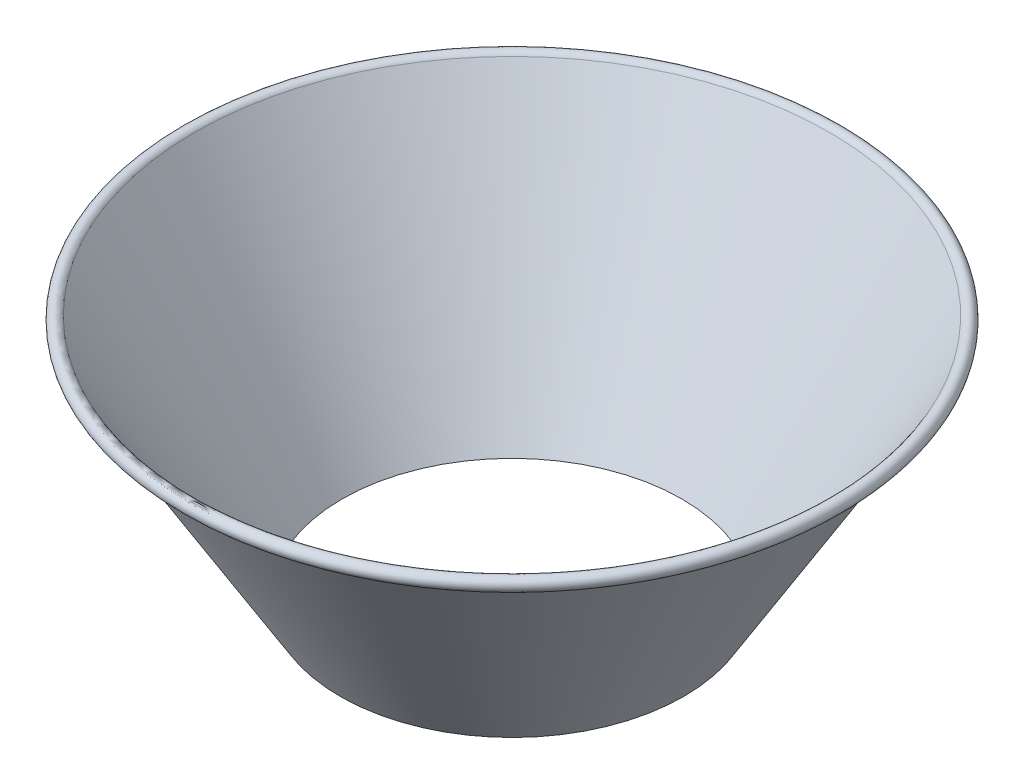
ISO-10303-21;
HEADER;
FILE_DESCRIPTION(('STEP AP214'),'2;1');
FILE_NAME('part.step','',(''),(''),'','','');
FILE_SCHEMA(('AUTOMOTIVE_DESIGN { 1 0 10303 214 1 1 1 1 }'));
ENDSEC;
DATA;
#1=APPLICATION_CONTEXT('core data for automotive mechanical design processes');
#2=APPLICATION_PROTOCOL_DEFINITION('international standard','automotive_design',2000,#1);
#3=PRODUCT_CONTEXT('',#1,'mechanical');
#4=PRODUCT('Part','Part','',(#3));
#5=PRODUCT_RELATED_PRODUCT_CATEGORY('part','',(#4));
#6=PRODUCT_DEFINITION_FORMATION('','',#4);
#7=PRODUCT_DEFINITION_CONTEXT('part definition',#1,'design');
#8=PRODUCT_DEFINITION('design','',#6,#7);
#9=PRODUCT_DEFINITION_SHAPE('','',#8);
#10=(LENGTH_UNIT() NAMED_UNIT(*) SI_UNIT(.MILLI.,.METRE.));
#11=(NAMED_UNIT(*) PLANE_ANGLE_UNIT() SI_UNIT($,.RADIAN.));
#12=(NAMED_UNIT(*) SI_UNIT($,.STERADIAN.) SOLID_ANGLE_UNIT());
#13=UNCERTAINTY_MEASURE_WITH_UNIT(LENGTH_MEASURE(1.E-05),#10,'distance_accuracy_value','');
#14=(GEOMETRIC_REPRESENTATION_CONTEXT(3) GLOBAL_UNCERTAINTY_ASSIGNED_CONTEXT((#13)) GLOBAL_UNIT_ASSIGNED_CONTEXT((#10,
#11,#12)) REPRESENTATION_CONTEXT('',''));
#15=CARTESIAN_POINT('',(0.,0.,0.));
#16=DIRECTION('',(0.,0.,1.));
#17=DIRECTION('',(1.,0.,0.));
#18=AXIS2_PLACEMENT_3D('',#15,#16,#17);
#19=CARTESIAN_POINT('',(0.,74.7395,0.));
#20=DIRECTION('',(0.,1.,0.));
#21=DIRECTION('',(-1.,0.,0.));
#22=AXIS2_PLACEMENT_3D('',#19,#20,#21);
#23=TOROIDAL_SURFACE('',#22,71.5645,1.46050000000002);
#24=CARTESIAN_POINT('',(0.,73.279,0.));
#25=DIRECTION('',(0.,1.,0.));
#26=DIRECTION('',(-1.,0.,0.));
#27=AXIS2_PLACEMENT_3D('',#24,#25,#26);
#28=CIRCLE('',#27,71.5645);
#29=CARTESIAN_POINT('',(-71.5645,73.279,0.));
#30=VERTEX_POINT('',#29);
#31=EDGE_CURVE('E71',#30,#30,#28,.T.);
#32=ORIENTED_EDGE('',*,*,#31,.T.);
#33=EDGE_LOOP('',(#32));
#34=FACE_BOUND('',#33,.T.);
#35=CARTESIAN_POINT('',(0.,75.4946142821155,0.));
#36=DIRECTION('',(0.,1.,0.));
#37=DIRECTION('',(-1.,0.,0.));
#38=AXIS2_PLACEMENT_3D('',#35,#36,#37);
#39=CIRCLE('',#38,70.3143549400388);
#40=CARTESIAN_POINT('',(-70.3143549400389,75.4946142821155,0.));
#41=VERTEX_POINT('',#40);
#42=EDGE_CURVE('E63',#41,#41,#39,.T.);
#43=ORIENTED_EDGE('',*,*,#42,.F.);
#44=EDGE_LOOP('',(#43));
#45=FACE_BOUND('',#44,.T.);
#46=ADVANCED_FACE('F39',(#34,#45),#23,.T.);
#47=CARTESIAN_POINT('',(0.,-18.669,0.));
#48=DIRECTION('',(0.,1.,0.));
#49=DIRECTION('',(-1.,0.,0.));
#50=AXIS2_PLACEMENT_3D('',#47,#48,#49);
#51=CONICAL_SURFACE('',#50,13.4375233807888,0.54337111564832);
#52=CARTESIAN_POINT('',(0.,21.4450023454756,0.));
#53=DIRECTION('',(0.,1.,0.));
#54=DIRECTION('',(0.,0.,1.));
#55=AXIS2_PLACEMENT_3D('',#52,#53,#54);
#56=CIRCLE('',#55,37.6672364389069);
#57=CARTESIAN_POINT('',(0.,21.4450023454756,37.667236438907));
#58=VERTEX_POINT('',#57);
#59=EDGE_CURVE('E68',#58,#58,#56,.T.);
#60=ORIENTED_EDGE('',*,*,#59,.F.);
#61=EDGE_LOOP('',(#60));
#62=FACE_BOUND('',#61,.T.);
#63=ORIENTED_EDGE('',*,*,#42,.T.);
#64=EDGE_LOOP('',(#63));
#65=FACE_BOUND('',#64,.T.);
#66=ADVANCED_FACE('F85',(#62,#65),#51,.F.);
#67=CARTESIAN_POINT('',(0.,75.2976279476506,0.));
#68=DIRECTION('',(0.,1.,0.));
#69=DIRECTION('',(-1.,0.,0.));
#70=AXIS2_PLACEMENT_3D('',#67,#68,#69);
#71=CONICAL_SURFACE('',#70,70.6404797382896,0.54337111564835);
#72=CARTESIAN_POINT('',(-38.0876548150612,168.081843546247,120.823003171525));
#73=CARTESIAN_POINT('',(-38.0876548150612,165.648551217745,119.281925192194));
#74=CARTESIAN_POINT('',(-38.0876548150612,163.216445597273,117.738971313603));
#75=CARTESIAN_POINT('',(-38.0876548150612,158.354939923969,114.648793918809));
#76=CARTESIAN_POINT('',(-38.0876548150612,155.925539877974,113.10157039185));
#77=CARTESIAN_POINT('',(-38.0876548150612,151.067729864395,110.001028867973));
#78=CARTESIAN_POINT('',(-38.0876548150612,148.63932248566,108.447706814018));
#79=CARTESIAN_POINT('',(-38.0876548150612,143.785983873332,105.335648390206));
#80=CARTESIAN_POINT('',(-38.0876548150612,141.361052634631,103.776912028318));
#81=CARTESIAN_POINT('',(-38.0876548150612,136.465336129185,100.621171617786));
#82=CARTESIAN_POINT('',(-38.0876548150612,133.994633245946,99.0240397281572));
#83=CARTESIAN_POINT('',(-38.0876548150612,129.057982270074,95.8224217122467));
#84=CARTESIAN_POINT('',(-38.0876548150612,126.592034195362,94.2179355583255));
#85=CARTESIAN_POINT('',(-38.0876548150612,121.667705356048,91.0018061663002));
#86=CARTESIAN_POINT('',(-38.0876548150612,119.209320031035,89.3901699129933));
#87=CARTESIAN_POINT('',(-38.0876548150612,114.299059973019,86.1570739835746));
#88=CARTESIAN_POINT('',(-38.0876548150612,111.847185154128,84.5356144379904));
#89=CARTESIAN_POINT('',(-38.0876548150612,107.691578120333,81.7733370093469));
#90=CARTESIAN_POINT('',(-38.0876548150612,105.985874445971,80.6354849650351));
#91=CARTESIAN_POINT('',(-38.0876548150612,102.578700330236,78.3534566396694));
#92=CARTESIAN_POINT('',(-38.0876548150612,100.877229890383,77.2092803563468));
#93=CARTESIAN_POINT('',(-38.0876548150612,97.4789926877367,74.9137084242104));
#94=CARTESIAN_POINT('',(-38.0876548150612,95.7822262588689,73.7623122808913));
#95=CARTESIAN_POINT('',(-38.0876548150612,92.3942223841081,71.451411131646));
#96=CARTESIAN_POINT('',(-38.0876548150612,90.7029849368961,70.2919061276548));
#97=CARTESIAN_POINT('',(-38.0876548150612,87.3219156311028,67.9601997255355));
#98=CARTESIAN_POINT('',(-38.0876548150612,85.6321026309994,66.7879709667249));
#99=CARTESIAN_POINT('',(-38.0876548150612,82.2599546885567,64.4327941320201));
#100=CARTESIAN_POINT('',(-38.0876548150612,80.5776197568551,63.2498460408844));
#101=CARTESIAN_POINT('',(-38.0876548150612,77.2221373154345,60.8718106736305));
#102=CARTESIAN_POINT('',(-38.0876548150612,75.5489877421685,59.6767263116331));
#103=CARTESIAN_POINT('',(-38.0876548150612,72.2131348110702,57.2720641664877));
#104=CARTESIAN_POINT('',(-38.0876548150612,70.5504314165469,56.0624864342891));
#105=CARTESIAN_POINT('',(-38.0876548150612,67.2611577528088,53.6435882695965));
#106=CARTESIAN_POINT('',(-38.0876548150612,65.6344100866802,52.4345093868182));
#107=CARTESIAN_POINT('',(-38.0876548150612,62.3957130032486,49.9966148906589));
#108=CARTESIAN_POINT('',(-38.0876548150612,60.7837638252043,48.7677989590535));
#109=CARTESIAN_POINT('',(-38.0876548150612,57.5765159062242,46.285252908823));
#110=CARTESIAN_POINT('',(-38.0876548150612,55.9812355222851,45.0314989979931));
#111=CARTESIAN_POINT('',(-38.0876548150612,53.6056695503966,43.1292605938618));
#112=CARTESIAN_POINT('',(-38.0876548150612,52.8167179509097,42.4915892528432));
#113=CARTESIAN_POINT('',(-38.0876548150612,51.245362842905,41.2082341776631));
#114=CARTESIAN_POINT('',(-38.0876548150612,50.4629592753172,40.5625505159113));
#115=CARTESIAN_POINT('',(-38.0876548150612,48.90970279517,39.2657102940267));
#116=CARTESIAN_POINT('',(-38.0876548150612,48.1388106833562,38.6146007211529));
#117=CARTESIAN_POINT('',(-38.0876548150612,46.6054343817125,37.3025395351501));
#118=CARTESIAN_POINT('',(-38.0876548150612,45.8429502201257,36.6415878889783));
#119=CARTESIAN_POINT('',(-38.0876548150612,44.327488840679,35.3085081185429));
#120=CARTESIAN_POINT('',(-38.0876548150612,43.5745138747313,34.6363774311122));
#121=CARTESIAN_POINT('',(-38.0876548150612,42.0798092000607,33.2797210155235));
#122=CARTESIAN_POINT('',(-38.0876548150612,41.3380793916203,32.5951953973967));
#123=CARTESIAN_POINT('',(-38.0876548150612,39.8690751711976,31.2133739506006));
#124=CARTESIAN_POINT('',(-38.0876548150612,39.1417773879191,30.5161030099));
#125=CARTESIAN_POINT('',(-38.0876548150612,37.7026087882811,29.1057224812742));
#126=CARTESIAN_POINT('',(-38.0876548150612,36.9907386001211,28.3926122507708));
#127=CARTESIAN_POINT('',(-38.0876548150612,35.5857654152034,26.9487713188204));
#128=CARTESIAN_POINT('',(-38.0876548150612,34.8926535854577,26.2180492281139));
#129=CARTESIAN_POINT('',(-38.0876548150612,33.5286480450629,24.7362133011933));
#130=CARTESIAN_POINT('',(-38.0876548150612,32.8577514147858,23.9851021684063));
#131=CARTESIAN_POINT('',(-38.0876548150612,32.0074562921743,22.9985014779341));
#132=CARTESIAN_POINT('',(-38.0876548150612,31.8156828965234,22.7736314110162));
#133=CARTESIAN_POINT('',(-38.0876548150612,31.4346035916423,22.3217873230872));
#134=CARTESIAN_POINT('',(-38.0876548150612,31.2452978094343,22.0948131947892));
#135=CARTESIAN_POINT('',(-38.0876548150612,30.8692839239541,21.6386519023495));
#136=CARTESIAN_POINT('',(-38.0876548150612,30.6825763068603,21.4094643372598));
#137=CARTESIAN_POINT('',(-38.0876548150612,30.3119668670527,20.9488378900014));
#138=CARTESIAN_POINT('',(-38.0876548150612,30.1280650127229,20.717399033249));
#139=CARTESIAN_POINT('',(-38.0876548150612,29.5806917865106,20.0193952128081));
#140=CARTESIAN_POINT('',(-38.0876548150612,29.2216888608861,19.5493076875629));
#141=CARTESIAN_POINT('',(-38.0876548150612,28.5172538154346,18.5990855641504));
#142=CARTESIAN_POINT('',(-38.0876548150612,28.1718211976454,18.1189513356395));
#143=CARTESIAN_POINT('',(-38.0876548150612,27.4995744361501,17.1524583187397));
#144=CARTESIAN_POINT('',(-38.0876548150612,27.172616106387,16.6662000825786));
#145=CARTESIAN_POINT('',(-38.0876548150612,26.5359991045371,15.6824348622619));
#146=CARTESIAN_POINT('',(-38.0876548150612,26.2263410227084,15.1849274951158));
#147=CARTESIAN_POINT('',(-38.0876548150612,25.62690664767,14.1782522848301));
#148=CARTESIAN_POINT('',(-38.0876548150612,25.3371238944485,13.6690883028568));
#149=CARTESIAN_POINT('',(-38.0876548150612,24.7801974310848,12.6385812415258));
#150=CARTESIAN_POINT('',(-38.0876548150612,24.5130509286648,12.1172396744756));
#151=CARTESIAN_POINT('',(-38.0876548150612,23.9400087042496,10.9282362893786));
#152=CARTESIAN_POINT('',(-38.0876548150612,23.6414652653594,10.2569943591806));
#153=CARTESIAN_POINT('',(-38.0876548150612,23.0918023706047,8.89535603427112));
#154=CARTESIAN_POINT('',(-38.0876548150612,22.8406746224838,8.20496301305006));
#155=CARTESIAN_POINT('',(-38.0876548150612,22.3934106131096,6.80768301408861));
#156=CARTESIAN_POINT('',(-38.0876548150612,22.1971860298175,6.10082453208847));
#157=CARTESIAN_POINT('',(-38.0876548150612,21.8660995361788,4.67260139782912));
#158=CARTESIAN_POINT('',(-38.0876548150612,21.7312377000805,3.95123672801865));
#159=CARTESIAN_POINT('',(-38.0876548150612,21.5785884070241,2.8587206712058));
#160=CARTESIAN_POINT('',(-38.0876548150612,21.5358914712146,2.49091772781046));
#161=CARTESIAN_POINT('',(-38.0876548150612,21.4679950496432,1.75371420860953));
#162=CARTESIAN_POINT('',(-38.0876548150612,21.4427934736389,1.38431382896435));
#163=CARTESIAN_POINT('',(-38.0876548150612,21.4101881093258,0.644710053627098));
#164=CARTESIAN_POINT('',(-38.0876548150612,21.4027853865662,0.27450661118658));
#165=CARTESIAN_POINT('',(-38.0876548150612,21.4058635883615,-0.465784828071986));
#166=CARTESIAN_POINT('',(-38.0876548150612,21.4163425347696,-0.835872833130432));
#167=CARTESIAN_POINT('',(-38.0876548150612,21.4550805517603,-1.57549750378557));
#168=CARTESIAN_POINT('',(-38.0876548150612,21.4833576986873,-1.94503322553982));
#169=CARTESIAN_POINT('',(-38.0876548150612,21.5573635637012,-2.68230918303501));
#170=CARTESIAN_POINT('',(-38.0876548150612,21.6030915844276,-3.05004948992848));
#171=CARTESIAN_POINT('',(-38.0876548150612,21.7657485021896,-4.14954741396918));
#172=CARTESIAN_POINT('',(-38.0876548150612,21.9081544416412,-4.87765883774081));
#173=CARTESIAN_POINT('',(-38.0876548150612,22.286713845738,-6.45014912277065));
#174=CARTESIAN_POINT('',(-38.0876548150612,22.5352281696663,-7.29151420852141));
#175=CARTESIAN_POINT('',(-38.0876548150612,23.1072123330818,-8.94859944125409));
#176=CARTESIAN_POINT('',(-38.0876548150612,23.430722530745,-9.7643055107449));
#177=CARTESIAN_POINT('',(-38.0876548150612,23.9632573727241,-10.9676286382808));
#178=CARTESIAN_POINT('',(-38.0876548150612,24.1489015353092,-11.36583492349));
#179=CARTESIAN_POINT('',(-38.0876548150612,24.5344190314017,-12.1551061446125));
#180=CARTESIAN_POINT('',(-38.0876548150612,24.7342861317781,-12.5461741155871));
#181=CARTESIAN_POINT('',(-38.0876548150612,25.1469691607501,-13.3213979739704));
#182=CARTESIAN_POINT('',(-38.0876548150612,25.3597852401153,-13.7055537808306));
#183=CARTESIAN_POINT('',(-38.0876548150612,25.7971716602247,-14.467179829362));
#184=CARTESIAN_POINT('',(-38.0876548150612,26.0217438238315,-14.8446490220101));
#185=CARTESIAN_POINT('',(-38.0876548150612,26.5521746246227,-15.7081245746477));
#186=CARTESIAN_POINT('',(-38.0876548150612,26.8617967781157,-16.1918197574383));
#187=CARTESIAN_POINT('',(-38.0876548150612,27.4969698248948,-17.1486733667581));
#188=CARTESIAN_POINT('',(-38.0876548150612,27.8225224516449,-17.6218306384235));
#189=CARTESIAN_POINT('',(-38.0876548150612,28.4877183939495,-18.5583560295845));
#190=CARTESIAN_POINT('',(-38.0876548150612,28.8273663966491,-19.0217208142102));
#191=CARTESIAN_POINT('',(-38.0876548150612,29.5190087914117,-19.93915807313));
#192=CARTESIAN_POINT('',(-38.0876548150612,29.8710039378488,-20.3932299769633));
#193=CARTESIAN_POINT('',(-38.0876548150612,30.9445786702881,-21.7440676898729));
#194=CARTESIAN_POINT('',(-38.0876548150612,31.682572602163,-22.6278205644663));
#195=CARTESIAN_POINT('',(-38.0876548150612,33.1927304890754,-24.3651391391388));
#196=CARTESIAN_POINT('',(-38.0876548150612,33.9648890431293,-25.218709572556));
#197=CARTESIAN_POINT('',(-38.0876548150612,35.542250974783,-26.9059763205005));
#198=CARTESIAN_POINT('',(-38.0876548150612,36.3476488399635,-27.7394902421869));
#199=CARTESIAN_POINT('',(-38.0876548150612,37.9810836623691,-29.3840175024714));
#200=CARTESIAN_POINT('',(-38.0876548150612,38.8091213304774,-30.1950301329209));
#201=CARTESIAN_POINT('',(-38.0876548150612,40.0646253535695,-31.3964482639423));
#202=CARTESIAN_POINT('',(-38.0876548150612,40.4851199797169,-31.794177683662));
#203=CARTESIAN_POINT('',(-38.0876548150612,41.3303514264109,-32.585105822505));
#204=CARTESIAN_POINT('',(-38.0876548150612,41.7550882438685,-32.9783045449269));
#205=CARTESIAN_POINT('',(-38.0876548150612,42.6084144453573,-33.7604610722337));
#206=CARTESIAN_POINT('',(-38.0876548150612,43.0370036736449,-34.1494190471673));
#207=CARTESIAN_POINT('',(-38.0876548150612,43.8977292952155,-34.9233873701068));
#208=CARTESIAN_POINT('',(-38.0876548150612,44.3298656906494,-35.3083977157187));
#209=CARTESIAN_POINT('',(-38.0876548150612,45.7303822371663,-36.5455584352396));
#210=CARTESIAN_POINT('',(-38.0876548150612,46.7052211566683,-37.3904085111028));
#211=CARTESIAN_POINT('',(-38.0876548150612,48.6683914288737,-39.0643103878748));
#212=CARTESIAN_POINT('',(-38.0876548150612,49.6567232605886,-39.8933616253933));
#213=CARTESIAN_POINT('',(-38.0876548150612,51.6448991790498,-41.537797394244));
#214=CARTESIAN_POINT('',(-38.0876548150612,52.6447447612912,-42.3531801156429));
#215=CARTESIAN_POINT('',(-38.0876548150612,54.6541330703226,-43.9718700072769));
#216=CARTESIAN_POINT('',(-38.0876548150612,55.6636756899806,-44.7751773106694));
#217=CARTESIAN_POINT('',(-38.0876548150612,57.69164520394,-46.3715814614122));
#218=CARTESIAN_POINT('',(-38.0876548150612,58.7100764474548,-47.164672778768));
#219=CARTESIAN_POINT('',(-38.0876548150612,60.7541989883781,-48.7414407856736));
#220=CARTESIAN_POINT('',(-38.0876548150612,61.7798903033331,-49.5251174524571));
#221=CARTESIAN_POINT('',(-38.0876548150612,63.8375450094514,-51.0840430733263));
#222=CARTESIAN_POINT('',(-38.0876548150612,64.8695079735142,-51.8592925914943));
#223=CARTESIAN_POINT('',(-38.0876548150612,66.9390185140117,-53.402305015757));
#224=CARTESIAN_POINT('',(-38.0876548150612,67.9765661160299,-54.1700678875096));
#225=CARTESIAN_POINT('',(-38.0876548150612,71.1005690222989,-56.4662274285432));
#226=CARTESIAN_POINT('',(-38.0876548150612,73.1944513505573,-57.9845253186376));
#227=CARTESIAN_POINT('',(-38.0876548150612,77.3979095083253,-60.9992450480099));
#228=CARTESIAN_POINT('',(-38.0876548150612,79.5074855404084,-62.4956666041677));
#229=CARTESIAN_POINT('',(-38.0876548150612,83.7387286800812,-65.469976648136));
#230=CARTESIAN_POINT('',(-38.0876548150612,85.8603920666994,-66.9478704339351));
#231=CARTESIAN_POINT('',(-38.0876548150612,90.1141541167086,-69.8885274232925));
#232=CARTESIAN_POINT('',(-38.0876548150612,92.246252732832,-71.351290695293));
#233=CARTESIAN_POINT('',(-38.0876548150612,96.5135561602564,-74.2602158828722));
#234=CARTESIAN_POINT('',(-38.0876548150612,98.6487381703079,-75.7064112701764));
#235=CARTESIAN_POINT('',(-38.0876548150612,102.926410209795,-78.587950050575));
#236=CARTESIAN_POINT('',(-38.0876548150612,105.068900244187,-80.0232934363084));
#237=CARTESIAN_POINT('',(-38.0876548150612,109.360249525592,-82.8847355799604));
#238=CARTESIAN_POINT('',(-38.0876548150612,111.509109190085,-84.3108337114878));
#239=CARTESIAN_POINT('',(-38.0876548150612,115.812180793713,-87.1549299326753));
#240=CARTESIAN_POINT('',(-38.0876548150612,117.966392733977,-88.572928020624));
#241=CARTESIAN_POINT('',(-38.0876548150612,122.277573330156,-91.4006195682699));
#242=CARTESIAN_POINT('',(-38.0876548150612,124.434537945681,-92.810319190041));
#243=CARTESIAN_POINT('',(-38.0876548150612,128.752508001349,-95.6235183322525));
#244=CARTESIAN_POINT('',(-38.0876548150612,130.913513444746,-97.0270178476958));
#245=CARTESIAN_POINT('',(-38.0876548150612,135.239073336351,-99.8285399569471));
#246=CARTESIAN_POINT('',(-38.0876548150612,137.403627787571,-101.226562546104));
#247=CARTESIAN_POINT('',(-38.0876548150612,141.735870250438,-104.017744210696));
#248=CARTESIAN_POINT('',(-38.0876548150612,143.903558262736,-105.410903285122));
#249=CARTESIAN_POINT('',(-38.0876548150612,147.903233550735,-107.975818793963));
#250=CARTESIAN_POINT('',(-38.0876548150612,149.734820514643,-109.148199620322));
#251=CARTESIAN_POINT('',(-38.0876548150612,153.400011698694,-111.490282238694));
#252=CARTESIAN_POINT('',(-38.0876548150612,155.233616131932,-112.659983697208));
#253=CARTESIAN_POINT('',(-38.0876548150612,158.902237123805,-114.996668119682));
#254=CARTESIAN_POINT('',(-38.0876548150612,160.737253479563,-116.163651402205));
#255=CARTESIAN_POINT('',(-38.0876548150612,164.408567522735,-118.495115966791));
#256=CARTESIAN_POINT('',(-38.0876548150612,166.244865030971,-119.659597530988));
#257=CARTESIAN_POINT('',(-38.0876548150612,168.081843546247,-120.823003171525));
#258=B_SPLINE_CURVE_WITH_KNOTS('',3,(#72,#73,#74,#75,#76,#77,#78,#79,#80,#81,#82,#83,#84,#85,
#86,#87,#88,#89,#90,#91,#92,#93,#94,#95,#96,#97,#98,#99,#100,#101,#102,#103,#104,#105,#106,#107,
#108,#109,#110,#111,#112,#113,#114,#115,#116,#117,#118,#119,#120,#121,#122,#123,#124,#125,#126,
#127,#128,#129,#130,#131,#132,#133,#134,#135,#136,#137,#138,#139,#140,#141,#142,#143,#144,#145,
#146,#147,#148,#149,#150,#151,#152,#153,#154,#155,#156,#157,#158,#159,#160,#161,#162,#163,#164,
#165,#166,#167,#168,#169,#170,#171,#172,#173,#174,#175,#176,#177,#178,#179,#180,#181,#182,#183,
#184,#185,#186,#187,#188,#189,#190,#191,#192,#193,#194,#195,#196,#197,#198,#199,#200,#201,#202,
#203,#204,#205,#206,#207,#208,#209,#210,#211,#212,#213,#214,#215,#216,#217,#218,#219,#220,#221,
#222,#223,#224,#225,#226,#227,#228,#229,#230,#231,#232,#233,#234,#235,#236,#237,#238,#239,#240,
#241,#242,#243,#244,#245,#246,#247,#248,#249,#250,#251,#252,#253,#254,#255,#256,#257),
.UNSPECIFIED.,.F.,.F.,(4,2,2,2,2,2,2,2,2,2,2,2,2,2,2,2,2,2,2,2,2,2,2,2,2,2,2,2,2,2,2,2,2,2,2,2,
2,2,2,2,2,2,2,2,2,2,2,2,2,2,2,2,2,2,2,2,2,2,2,2,2,2,2,2,2,2,2,2,2,2,2,2,2,2,2,2,2,2,2,2,2,2,2,2,
2,2,2,2,2,2,2,2,4),(0.,8.64074711120191,17.281516013061,25.9296161269713,34.5777035186858,
43.403610183124,52.2295500457246,61.0482191779913,69.8667713875769,76.0179537593442,
82.169138337896,88.3207489306777,94.4723580556549,100.642111183688,106.811873085606,
112.980186996667,119.14847923021,125.228946097038,131.309511099021,137.396185600915,
140.439434782314,143.482656480928,146.509787761551,149.536929207449,152.564774565246,
155.592593057646,158.615024394013,161.637578571032,164.658683802168,167.67939039643,
168.565996385422,169.452647834234,170.339463023956,171.22626821344,173.000519376337,
174.774705372175,176.532258644442,178.289871845157,180.046911040639,181.803733181367,
184.006050965348,186.207983241227,188.406352658748,190.604724736269,191.715194829519,
192.825532227511,193.935936095493,195.046217133804,196.157627627806,197.268993713006,
199.491496051763,202.119336141011,204.748593668793,206.066427127575,207.383686567532,
208.70096134775,210.018440989085,211.740984695192,213.463716257382,215.187025344403,
216.910439904546,220.363302074847,223.815620329222,227.29226181542,230.769012592805,
232.505373419093,234.2417329811,235.978022659247,237.714313390274,241.584070491386,
245.453965331725,249.324368624374,253.194729206188,257.067103546869,260.939487249779,
264.811610133466,268.683750770661,276.442815757678,284.201981072632,291.958874593126,
299.71573301024,307.452253555296,315.188779347652,322.92582394455,330.662870176123,
338.393171479446,346.123479011942,353.853793107961,361.584108808267,368.108114755738,
374.632892847908,381.156863335057,387.68005476384),.UNSPECIFIED.);
#259=CARTESIAN_POINT('',(-38.0876548150612,21.4450023454756,1.37164360702084));
#260=VERTEX_POINT('',#259);
#261=CARTESIAN_POINT('',(-38.0876548150612,21.4450023454756,-1.37164360702086));
#262=VERTEX_POINT('',#261);
#263=EDGE_CURVE('E11',#260,#262,#258,.T.);
#264=ORIENTED_EDGE('',*,*,#263,.F.);
#265=CARTESIAN_POINT('',(0.,21.4450023454756,0.));
#266=DIRECTION('',(0.,1.,0.));
#267=DIRECTION('',(0.,0.,1.));
#268=AXIS2_PLACEMENT_3D('',#265,#266,#267);
#269=CIRCLE('',#268,38.1123451849388);
#270=EDGE_CURVE('E52',#262,#260,#269,.F.);
#271=ORIENTED_EDGE('',*,*,#270,.F.);
#272=EDGE_LOOP('',(#264,#271));
#273=FACE_BOUND('',#272,.T.);
#274=CARTESIAN_POINT('',(0.,75.2976279476506,0.));
#275=DIRECTION('',(0.,1.,0.));
#276=DIRECTION('',(-1.,0.,0.));
#277=AXIS2_PLACEMENT_3D('',#274,#275,#276);
#278=CIRCLE('',#277,70.6404797382896);
#279=CARTESIAN_POINT('',(-70.6404797382896,75.2976279476506,0.));
#280=VERTEX_POINT('',#279);
#281=EDGE_CURVE('E79',#280,#280,#278,.T.);
#282=ORIENTED_EDGE('',*,*,#281,.F.);
#283=EDGE_LOOP('',(#282));
#284=FACE_BOUND('',#283,.T.);
#285=ADVANCED_FACE('F61',(#273,#284),#71,.T.);
#286=CARTESIAN_POINT('',(0.,74.7395,0.));
#287=DIRECTION('',(0.,1.,0.));
#288=DIRECTION('',(-1.,0.,0.));
#289=AXIS2_PLACEMENT_3D('',#286,#287,#288);
#290=TOROIDAL_SURFACE('',#289,71.5645,1.07949999999998);
#291=ORIENTED_EDGE('',*,*,#281,.T.);
#292=EDGE_LOOP('',(#291));
#293=FACE_BOUND('',#292,.T.);
#294=CARTESIAN_POINT('',(0.,73.66,0.));
#295=DIRECTION('',(0.,1.,0.));
#296=DIRECTION('',(-1.,0.,0.));
#297=AXIS2_PLACEMENT_3D('',#294,#295,#296);
#298=CIRCLE('',#297,71.5645);
#299=CARTESIAN_POINT('',(-71.5645,73.66,0.));
#300=VERTEX_POINT('',#299);
#301=EDGE_CURVE('E76',#300,#300,#298,.T.);
#302=ORIENTED_EDGE('',*,*,#301,.F.);
#303=EDGE_LOOP('',(#302));
#304=FACE_BOUND('',#303,.T.);
#305=ADVANCED_FACE('F97',(#293,#304),#290,.F.);
#306=CARTESIAN_POINT('',(0.,76.2,0.));
#307=DIRECTION('',(0.,1.,0.));
#308=DIRECTION('',(-1.,0.,0.));
#309=AXIS2_PLACEMENT_3D('',#306,#307,#308);
#310=CYLINDRICAL_SURFACE('',#309,71.5645);
#311=ORIENTED_EDGE('',*,*,#301,.T.);
#312=EDGE_LOOP('',(#311));
#313=FACE_BOUND('',#312,.T.);
#314=ORIENTED_EDGE('',*,*,#31,.F.);
#315=EDGE_LOOP('',(#314));
#316=FACE_BOUND('',#315,.T.);
#317=ADVANCED_FACE('F95',(#313,#316),#310,.F.);
#318=CARTESIAN_POINT('',(-38.0876548150612,21.4450023454756,-73.025));
#319=DIRECTION('',(-1.,0.,0.));
#320=DIRECTION('',(0.,0.,1.));
#321=AXIS2_PLACEMENT_3D('',#318,#319,#320);
#322=PLANE('',#321);
#323=ORIENTED_EDGE('',*,*,#263,.T.);
#324=DIRECTION('',(0.,0.,1.));
#325=VECTOR('',#324,1.);
#326=CARTESIAN_POINT('',(-38.0876548150612,21.4450023454756,-73.025));
#327=LINE('',#326,#325);
#328=EDGE_CURVE('E66',#262,#260,#327,.T.);
#329=ORIENTED_EDGE('',*,*,#328,.T.);
#330=EDGE_LOOP('',(#323,#329));
#331=FACE_BOUND('',#330,.T.);
#332=ADVANCED_FACE('F65',(#331),#322,.F.);
#333=CARTESIAN_POINT('',(38.1123451849388,21.4450023454756,-73.025));
#334=DIRECTION('',(0.,1.,0.));
#335=DIRECTION('',(0.,0.,1.));
#336=AXIS2_PLACEMENT_3D('',#333,#334,#335);
#337=PLANE('',#336);
#338=ORIENTED_EDGE('',*,*,#59,.T.);
#339=EDGE_LOOP('',(#338));
#340=FACE_BOUND('',#339,.T.);
#341=ORIENTED_EDGE('',*,*,#328,.F.);
#342=ORIENTED_EDGE('',*,*,#270,.T.);
#343=EDGE_LOOP('',(#341,#342));
#344=FACE_BOUND('',#343,.T.);
#345=ADVANCED_FACE('F67',(#340,#344),#337,.F.);
#346=CLOSED_SHELL('',(#46,#66,#285,#305,#317,#332,#345));
#347=MANIFOLD_SOLID_BREP('B2',#346);
#348=ADVANCED_BREP_SHAPE_REPRESENTATION('',(#18,#347),#14);
#349=SHAPE_DEFINITION_REPRESENTATION(#9,#348);
ENDSEC;
END-ISO-10303-21;
